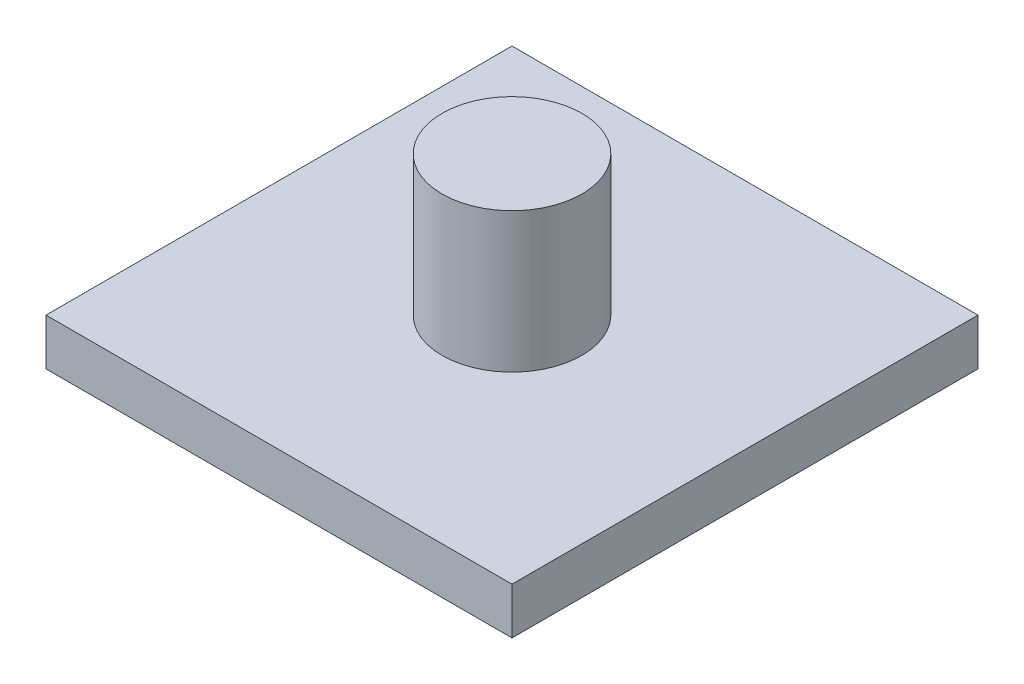
ISO-10303-21;
HEADER;
FILE_DESCRIPTION(('STEP AP214'),'2;1');
FILE_NAME('part.step','',(''),(''),'','','');
FILE_SCHEMA(('AUTOMOTIVE_DESIGN { 1 0 10303 214 1 1 1 1 }'));
ENDSEC;
DATA;
#1=APPLICATION_CONTEXT('core data for automotive mechanical design processes');
#2=APPLICATION_PROTOCOL_DEFINITION('international standard','automotive_design',2000,#1);
#3=PRODUCT_CONTEXT('',#1,'mechanical');
#4=PRODUCT('Part','Part','',(#3));
#5=PRODUCT_RELATED_PRODUCT_CATEGORY('part','',(#4));
#6=PRODUCT_DEFINITION_FORMATION('','',#4);
#7=PRODUCT_DEFINITION_CONTEXT('part definition',#1,'design');
#8=PRODUCT_DEFINITION('design','',#6,#7);
#9=PRODUCT_DEFINITION_SHAPE('','',#8);
#10=(LENGTH_UNIT() NAMED_UNIT(*) SI_UNIT(.MILLI.,.METRE.));
#11=(NAMED_UNIT(*) PLANE_ANGLE_UNIT() SI_UNIT($,.RADIAN.));
#12=(NAMED_UNIT(*) SI_UNIT($,.STERADIAN.) SOLID_ANGLE_UNIT());
#13=UNCERTAINTY_MEASURE_WITH_UNIT(LENGTH_MEASURE(1.E-05),#10,'distance_accuracy_value','');
#14=(GEOMETRIC_REPRESENTATION_CONTEXT(3) GLOBAL_UNCERTAINTY_ASSIGNED_CONTEXT((#13)) GLOBAL_UNIT_ASSIGNED_CONTEXT((#10,
#11,#12)) REPRESENTATION_CONTEXT('',''));
#15=CARTESIAN_POINT('',(0.,0.,0.));
#16=DIRECTION('',(0.,0.,1.));
#17=DIRECTION('',(1.,0.,0.));
#18=AXIS2_PLACEMENT_3D('',#15,#16,#17);
#19=CARTESIAN_POINT('',(0.,2.,0.));
#20=DIRECTION('',(1.,0.,0.));
#21=DIRECTION('',(0.,0.,-1.));
#22=AXIS2_PLACEMENT_3D('',#19,#20,#21);
#23=PLANE('',#22);
#24=DIRECTION('',(0.,0.,1.));
#25=VECTOR('',#24,1.);
#26=CARTESIAN_POINT('',(0.,0.,0.));
#27=LINE('',#26,#25);
#28=CARTESIAN_POINT('',(0.,0.,-20.));
#29=VERTEX_POINT('',#28);
#30=CARTESIAN_POINT('',(0.,0.,0.));
#31=VERTEX_POINT('',#30);
#32=EDGE_CURVE('E110',#29,#31,#27,.T.);
#33=ORIENTED_EDGE('',*,*,#32,.T.);
#34=DIRECTION('',(0.,-1.,0.));
#35=VECTOR('',#34,1.);
#36=CARTESIAN_POINT('',(0.,2.,0.));
#37=LINE('',#36,#35);
#38=CARTESIAN_POINT('',(0.,2.,0.));
#39=VERTEX_POINT('',#38);
#40=EDGE_CURVE('E42',#39,#31,#37,.T.);
#41=ORIENTED_EDGE('',*,*,#40,.F.);
#42=DIRECTION('',(0.,0.,1.));
#43=VECTOR('',#42,1.);
#44=CARTESIAN_POINT('',(0.,2.,0.));
#45=LINE('',#44,#43);
#46=CARTESIAN_POINT('',(0.,2.,-20.));
#47=VERTEX_POINT('',#46);
#48=EDGE_CURVE('E93',#47,#39,#45,.T.);
#49=ORIENTED_EDGE('',*,*,#48,.F.);
#50=DIRECTION('',(0.,-1.,0.));
#51=VECTOR('',#50,1.);
#52=CARTESIAN_POINT('',(0.,2.,-20.));
#53=LINE('',#52,#51);
#54=EDGE_CURVE('E106',#47,#29,#53,.T.);
#55=ORIENTED_EDGE('',*,*,#54,.T.);
#56=EDGE_LOOP('',(#33,#41,#49,#55));
#57=FACE_BOUND('',#56,.T.);
#58=ADVANCED_FACE('F39',(#57),#23,.F.);
#59=CARTESIAN_POINT('',(0.,2.,0.));
#60=DIRECTION('',(0.,0.,-1.));
#61=DIRECTION('',(-1.,0.,0.));
#62=AXIS2_PLACEMENT_3D('',#59,#60,#61);
#63=PLANE('',#62);
#64=DIRECTION('',(1.,0.,0.));
#65=VECTOR('',#64,1.);
#66=CARTESIAN_POINT('',(0.,0.,0.));
#67=LINE('',#66,#65);
#68=CARTESIAN_POINT('',(20.,0.,0.));
#69=VERTEX_POINT('',#68);
#70=EDGE_CURVE('E99',#31,#69,#67,.T.);
#71=ORIENTED_EDGE('',*,*,#70,.T.);
#72=DIRECTION('',(0.,-1.,0.));
#73=VECTOR('',#72,1.);
#74=CARTESIAN_POINT('',(20.,2.,0.));
#75=LINE('',#74,#73);
#76=CARTESIAN_POINT('',(20.,2.,0.));
#77=VERTEX_POINT('',#76);
#78=EDGE_CURVE('E97',#77,#69,#75,.T.);
#79=ORIENTED_EDGE('',*,*,#78,.F.);
#80=DIRECTION('',(1.,0.,0.));
#81=VECTOR('',#80,1.);
#82=CARTESIAN_POINT('',(0.,2.,0.));
#83=LINE('',#82,#81);
#84=EDGE_CURVE('E88',#39,#77,#83,.T.);
#85=ORIENTED_EDGE('',*,*,#84,.F.);
#86=ORIENTED_EDGE('',*,*,#40,.T.);
#87=EDGE_LOOP('',(#71,#79,#85,#86));
#88=FACE_BOUND('',#87,.T.);
#89=ADVANCED_FACE('F98',(#88),#63,.F.);
#90=CARTESIAN_POINT('',(20.,2.,0.));
#91=DIRECTION('',(-1.,0.,0.));
#92=DIRECTION('',(0.,0.,1.));
#93=AXIS2_PLACEMENT_3D('',#90,#91,#92);
#94=PLANE('',#93);
#95=DIRECTION('',(0.,0.,-1.));
#96=VECTOR('',#95,1.);
#97=CARTESIAN_POINT('',(20.,0.,0.));
#98=LINE('',#97,#96);
#99=CARTESIAN_POINT('',(20.,0.,-20.));
#100=VERTEX_POINT('',#99);
#101=EDGE_CURVE('E74',#69,#100,#98,.T.);
#102=ORIENTED_EDGE('',*,*,#101,.T.);
#103=DIRECTION('',(0.,-1.,0.));
#104=VECTOR('',#103,1.);
#105=CARTESIAN_POINT('',(20.,2.,-20.));
#106=LINE('',#105,#104);
#107=CARTESIAN_POINT('',(20.,2.,-20.));
#108=VERTEX_POINT('',#107);
#109=EDGE_CURVE('E101',#108,#100,#106,.T.);
#110=ORIENTED_EDGE('',*,*,#109,.F.);
#111=DIRECTION('',(0.,0.,-1.));
#112=VECTOR('',#111,1.);
#113=CARTESIAN_POINT('',(20.,2.,0.));
#114=LINE('',#113,#112);
#115=EDGE_CURVE('E91',#77,#108,#114,.T.);
#116=ORIENTED_EDGE('',*,*,#115,.F.);
#117=ORIENTED_EDGE('',*,*,#78,.T.);
#118=EDGE_LOOP('',(#102,#110,#116,#117));
#119=FACE_BOUND('',#118,.T.);
#120=ADVANCED_FACE('F102',(#119),#94,.F.);
#121=CARTESIAN_POINT('',(0.,2.,-20.));
#122=DIRECTION('',(0.,0.,1.));
#123=DIRECTION('',(1.,0.,0.));
#124=AXIS2_PLACEMENT_3D('',#121,#122,#123);
#125=PLANE('',#124);
#126=DIRECTION('',(-1.,0.,0.));
#127=VECTOR('',#126,1.);
#128=CARTESIAN_POINT('',(0.,0.,-20.));
#129=LINE('',#128,#127);
#130=EDGE_CURVE('E80',#100,#29,#129,.T.);
#131=ORIENTED_EDGE('',*,*,#130,.T.);
#132=ORIENTED_EDGE('',*,*,#54,.F.);
#133=DIRECTION('',(-1.,0.,0.));
#134=VECTOR('',#133,1.);
#135=CARTESIAN_POINT('',(0.,2.,-20.));
#136=LINE('',#135,#134);
#137=EDGE_CURVE('E57',#108,#47,#136,.T.);
#138=ORIENTED_EDGE('',*,*,#137,.F.);
#139=ORIENTED_EDGE('',*,*,#109,.T.);
#140=EDGE_LOOP('',(#131,#132,#138,#139));
#141=FACE_BOUND('',#140,.T.);
#142=ADVANCED_FACE('F124',(#141),#125,.F.);
#143=CARTESIAN_POINT('',(0.,2.,0.));
#144=DIRECTION('',(0.,-1.,0.));
#145=DIRECTION('',(0.,0.,-1.));
#146=AXIS2_PLACEMENT_3D('',#143,#144,#145);
#147=PLANE('',#146);
#148=CARTESIAN_POINT('',(10.,2.,-10.));
#149=DIRECTION('',(0.,1.,0.));
#150=DIRECTION('',(0.,0.,1.));
#151=AXIS2_PLACEMENT_3D('',#148,#149,#150);
#152=CIRCLE('',#151,3.);
#153=CARTESIAN_POINT('',(10.,2.,-7.));
#154=VERTEX_POINT('',#153);
#155=EDGE_CURVE('E11',#154,#154,#152,.T.);
#156=ORIENTED_EDGE('',*,*,#155,.F.);
#157=EDGE_LOOP('',(#156));
#158=FACE_BOUND('',#157,.T.);
#159=ORIENTED_EDGE('',*,*,#48,.T.);
#160=ORIENTED_EDGE('',*,*,#84,.T.);
#161=ORIENTED_EDGE('',*,*,#115,.T.);
#162=ORIENTED_EDGE('',*,*,#137,.T.);
#163=EDGE_LOOP('',(#159,#160,#161,#162));
#164=FACE_BOUND('',#163,.T.);
#165=ADVANCED_FACE('F89',(#158,#164),#147,.F.);
#166=CARTESIAN_POINT('',(0.,0.,0.));
#167=DIRECTION('',(0.,-1.,0.));
#168=DIRECTION('',(0.,0.,-1.));
#169=AXIS2_PLACEMENT_3D('',#166,#167,#168);
#170=PLANE('',#169);
#171=ORIENTED_EDGE('',*,*,#32,.F.);
#172=ORIENTED_EDGE('',*,*,#130,.F.);
#173=ORIENTED_EDGE('',*,*,#101,.F.);
#174=ORIENTED_EDGE('',*,*,#70,.F.);
#175=EDGE_LOOP('',(#171,#172,#173,#174));
#176=FACE_BOUND('',#175,.T.);
#177=ADVANCED_FACE('F127',(#176),#170,.T.);
#178=CARTESIAN_POINT('',(10.,8.,-10.));
#179=DIRECTION('',(0.,-1.,0.));
#180=DIRECTION('',(0.,0.,-1.));
#181=AXIS2_PLACEMENT_3D('',#178,#179,#180);
#182=CYLINDRICAL_SURFACE('',#181,3.);
#183=CARTESIAN_POINT('',(10.,8.,-10.));
#184=DIRECTION('',(0.,1.,0.));
#185=DIRECTION('',(0.,0.,1.));
#186=AXIS2_PLACEMENT_3D('',#183,#184,#185);
#187=CIRCLE('',#186,3.);
#188=CARTESIAN_POINT('',(10.,8.,-7.));
#189=VERTEX_POINT('',#188);
#190=EDGE_CURVE('E114',#189,#189,#187,.T.);
#191=ORIENTED_EDGE('',*,*,#190,.F.);
#192=EDGE_LOOP('',(#191));
#193=FACE_BOUND('',#192,.T.);
#194=ORIENTED_EDGE('',*,*,#155,.T.);
#195=EDGE_LOOP('',(#194));
#196=FACE_BOUND('',#195,.T.);
#197=ADVANCED_FACE('F137',(#193,#196),#182,.T.);
#198=CARTESIAN_POINT('',(10.,8.,-10.));
#199=DIRECTION('',(0.,1.,0.));
#200=DIRECTION('',(0.,0.,1.));
#201=AXIS2_PLACEMENT_3D('',#198,#199,#200);
#202=PLANE('',#201);
#203=ORIENTED_EDGE('',*,*,#190,.T.);
#204=EDGE_LOOP('',(#203));
#205=FACE_BOUND('',#204,.T.);
#206=ADVANCED_FACE('F135',(#205),#202,.T.);
#207=CLOSED_SHELL('',(#58,#89,#120,#142,#165,#177,#197,#206));
#208=MANIFOLD_SOLID_BREP('B2',#207);
#209=ADVANCED_BREP_SHAPE_REPRESENTATION('',(#18,#208),#14);
#210=SHAPE_DEFINITION_REPRESENTATION(#9,#209);
ENDSEC;
END-ISO-10303-21;
